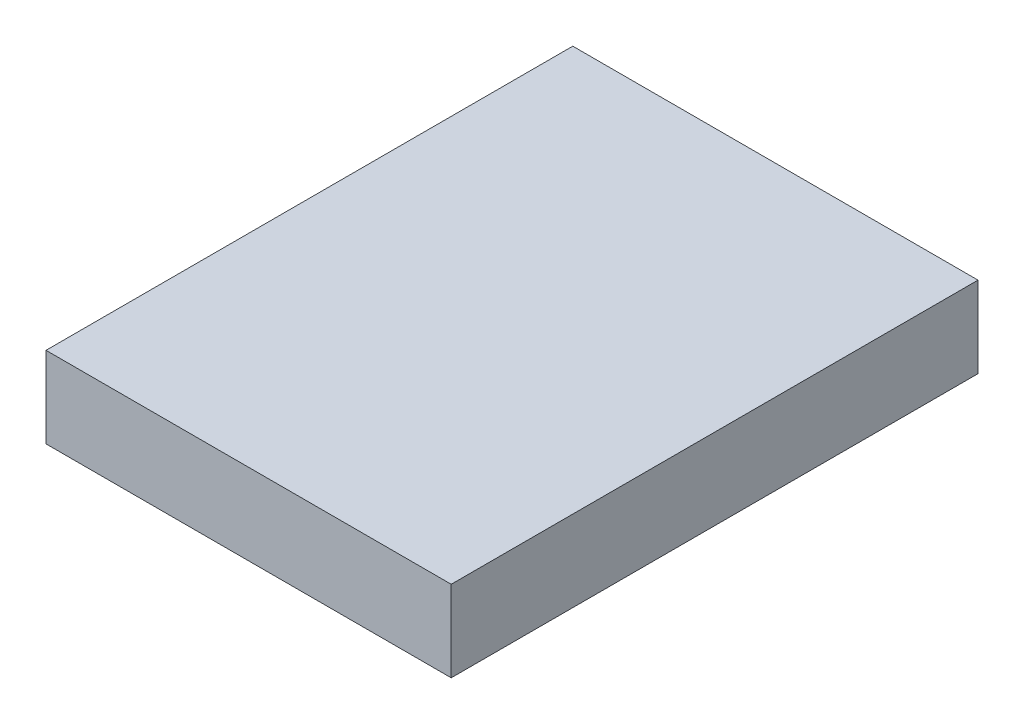
ISO-10303-21;
HEADER;
FILE_DESCRIPTION(('STEP AP214'),'2;1');
FILE_NAME('part.step','',(''),(''),'','','');
FILE_SCHEMA(('AUTOMOTIVE_DESIGN { 1 0 10303 214 1 1 1 1 }'));
ENDSEC;
DATA;
#1=APPLICATION_CONTEXT('core data for automotive mechanical design processes');
#2=APPLICATION_PROTOCOL_DEFINITION('international standard','automotive_design',2000,#1);
#3=PRODUCT_CONTEXT('',#1,'mechanical');
#4=PRODUCT('Part','Part','',(#3));
#5=PRODUCT_RELATED_PRODUCT_CATEGORY('part','',(#4));
#6=PRODUCT_DEFINITION_FORMATION('','',#4);
#7=PRODUCT_DEFINITION_CONTEXT('part definition',#1,'design');
#8=PRODUCT_DEFINITION('design','',#6,#7);
#9=PRODUCT_DEFINITION_SHAPE('','',#8);
#10=(LENGTH_UNIT() NAMED_UNIT(*) SI_UNIT(.MILLI.,.METRE.));
#11=(NAMED_UNIT(*) PLANE_ANGLE_UNIT() SI_UNIT($,.RADIAN.));
#12=(NAMED_UNIT(*) SI_UNIT($,.STERADIAN.) SOLID_ANGLE_UNIT());
#13=UNCERTAINTY_MEASURE_WITH_UNIT(LENGTH_MEASURE(1.E-05),#10,'distance_accuracy_value','');
#14=(GEOMETRIC_REPRESENTATION_CONTEXT(3) GLOBAL_UNCERTAINTY_ASSIGNED_CONTEXT((#13)) GLOBAL_UNIT_ASSIGNED_CONTEXT((#10,
#11,#12)) REPRESENTATION_CONTEXT('',''));
#15=CARTESIAN_POINT('',(0.,0.,0.));
#16=DIRECTION('',(0.,0.,1.));
#17=DIRECTION('',(1.,0.,0.));
#18=AXIS2_PLACEMENT_3D('',#15,#16,#17);
#19=CARTESIAN_POINT('',(0.,0.2,0.));
#20=DIRECTION('',(0.,1.,0.));
#21=DIRECTION('',(-1.,0.,0.));
#22=AXIS2_PLACEMENT_3D('',#19,#20,#21);
#23=PLANE('',#22);
#24=DIRECTION('',(0.,0.,-1.));
#25=VECTOR('',#24,1.);
#26=CARTESIAN_POINT('',(0.550000000000034,0.199999999999985,4.25));
#27=LINE('',#26,#25);
#28=CARTESIAN_POINT('',(0.550000000000034,0.199999999999985,4.25));
#29=VERTEX_POINT('',#28);
#30=CARTESIAN_POINT('',(0.550000000000034,0.199999999999989,2.94999999999999));
#31=VERTEX_POINT('',#30);
#32=EDGE_CURVE('E11',#29,#31,#27,.T.);
#33=ORIENTED_EDGE('',*,*,#32,.F.);
#34=DIRECTION('',(-1.,0.,0.));
#35=VECTOR('',#34,1.);
#36=CARTESIAN_POINT('',(0.550000000000034,0.199999999999985,4.25));
#37=LINE('',#36,#35);
#38=CARTESIAN_POINT('',(1.55000000000002,0.199999999999985,4.25000000000001));
#39=VERTEX_POINT('',#38);
#40=EDGE_CURVE('E24',#39,#29,#37,.T.);
#41=ORIENTED_EDGE('',*,*,#40,.F.);
#42=DIRECTION('',(0.,0.,1.));
#43=VECTOR('',#42,1.);
#44=CARTESIAN_POINT('',(1.55000000000002,0.199999999999985,4.25));
#45=LINE('',#44,#43);
#46=CARTESIAN_POINT('',(1.55000000000002,0.199999999999989,2.94999999999999));
#47=VERTEX_POINT('',#46);
#48=EDGE_CURVE('E75',#47,#39,#45,.T.);
#49=ORIENTED_EDGE('',*,*,#48,.F.);
#50=DIRECTION('',(1.,0.,0.));
#51=VECTOR('',#50,1.);
#52=CARTESIAN_POINT('',(0.550000000000034,0.199999999999989,2.94999999999999));
#53=LINE('',#52,#51);
#54=EDGE_CURVE('E85',#31,#47,#53,.T.);
#55=ORIENTED_EDGE('',*,*,#54,.F.);
#56=EDGE_LOOP('',(#33,#41,#49,#55));
#57=FACE_BOUND('',#56,.T.);
#58=ADVANCED_FACE('F17',(#57),#23,.T.);
#59=CARTESIAN_POINT('',(0.,0.,0.));
#60=DIRECTION('',(0.,-1.,0.));
#61=DIRECTION('',(0.,0.,-1.));
#62=AXIS2_PLACEMENT_3D('',#59,#60,#61);
#63=PLANE('',#62);
#64=DIRECTION('',(0.,0.,-1.));
#65=VECTOR('',#64,1.);
#66=CARTESIAN_POINT('',(0.550000000000034,0.,4.25));
#67=LINE('',#66,#65);
#68=CARTESIAN_POINT('',(0.550000000000034,0.,4.25));
#69=VERTEX_POINT('',#68);
#70=CARTESIAN_POINT('',(0.550000000000034,0.,2.94999999999999));
#71=VERTEX_POINT('',#70);
#72=EDGE_CURVE('E83',#69,#71,#67,.T.);
#73=ORIENTED_EDGE('',*,*,#72,.T.);
#74=DIRECTION('',(1.,0.,0.));
#75=VECTOR('',#74,1.);
#76=CARTESIAN_POINT('',(0.550000000000034,0.,2.94999999999999));
#77=LINE('',#76,#75);
#78=CARTESIAN_POINT('',(1.55000000000002,0.,2.94999999999999));
#79=VERTEX_POINT('',#78);
#80=EDGE_CURVE('E60',#71,#79,#77,.T.);
#81=ORIENTED_EDGE('',*,*,#80,.T.);
#82=DIRECTION('',(0.,0.,1.));
#83=VECTOR('',#82,1.);
#84=CARTESIAN_POINT('',(1.55000000000002,0.,4.25));
#85=LINE('',#84,#83);
#86=CARTESIAN_POINT('',(1.55000000000002,0.,4.25));
#87=VERTEX_POINT('',#86);
#88=EDGE_CURVE('E54',#79,#87,#85,.T.);
#89=ORIENTED_EDGE('',*,*,#88,.T.);
#90=DIRECTION('',(-1.,0.,0.));
#91=VECTOR('',#90,1.);
#92=CARTESIAN_POINT('',(0.550000000000034,0.,4.25));
#93=LINE('',#92,#91);
#94=EDGE_CURVE('E57',#87,#69,#93,.T.);
#95=ORIENTED_EDGE('',*,*,#94,.T.);
#96=EDGE_LOOP('',(#73,#81,#89,#95));
#97=FACE_BOUND('',#96,.T.);
#98=ADVANCED_FACE('F56',(#97),#63,.T.);
#99=CARTESIAN_POINT('',(0.550000000000034,4.22492235949961,2.95000000000001));
#100=DIRECTION('',(0.,0.,-1.));
#101=DIRECTION('',(0.,1.,0.));
#102=AXIS2_PLACEMENT_3D('',#99,#100,#101);
#103=PLANE('',#102);
#104=DIRECTION('',(0.,-1.,0.));
#105=VECTOR('',#104,1.);
#106=CARTESIAN_POINT('',(0.550000000000034,4.22492235949961,2.95000000000001));
#107=LINE('',#106,#105);
#108=EDGE_CURVE('E71',#31,#71,#107,.T.);
#109=ORIENTED_EDGE('',*,*,#108,.F.);
#110=ORIENTED_EDGE('',*,*,#54,.T.);
#111=DIRECTION('',(0.,-1.,0.));
#112=VECTOR('',#111,1.);
#113=CARTESIAN_POINT('',(1.55000000000002,4.22492235949961,2.95000000000001));
#114=LINE('',#113,#112);
#115=EDGE_CURVE('E76',#47,#79,#114,.T.);
#116=ORIENTED_EDGE('',*,*,#115,.T.);
#117=ORIENTED_EDGE('',*,*,#80,.F.);
#118=EDGE_LOOP('',(#109,#110,#116,#117));
#119=FACE_BOUND('',#118,.T.);
#120=ADVANCED_FACE('F91',(#119),#103,.T.);
#121=CARTESIAN_POINT('',(1.55000000000002,4.22492235949961,4.25000000000001));
#122=DIRECTION('',(1.,0.,0.));
#123=DIRECTION('',(0.,1.,0.));
#124=AXIS2_PLACEMENT_3D('',#121,#122,#123);
#125=PLANE('',#124);
#126=ORIENTED_EDGE('',*,*,#115,.F.);
#127=ORIENTED_EDGE('',*,*,#48,.T.);
#128=DIRECTION('',(0.,-1.,0.));
#129=VECTOR('',#128,1.);
#130=CARTESIAN_POINT('',(1.55000000000002,4.22492235949961,4.25000000000001));
#131=LINE('',#130,#129);
#132=EDGE_CURVE('E69',#39,#87,#131,.T.);
#133=ORIENTED_EDGE('',*,*,#132,.T.);
#134=ORIENTED_EDGE('',*,*,#88,.F.);
#135=EDGE_LOOP('',(#126,#127,#133,#134));
#136=FACE_BOUND('',#135,.T.);
#137=ADVANCED_FACE('F74',(#136),#125,.T.);
#138=CARTESIAN_POINT('',(0.550000000000034,4.22492235949961,4.25000000000001));
#139=DIRECTION('',(0.,0.,1.));
#140=DIRECTION('',(0.,-1.,0.));
#141=AXIS2_PLACEMENT_3D('',#138,#139,#140);
#142=PLANE('',#141);
#143=ORIENTED_EDGE('',*,*,#132,.F.);
#144=ORIENTED_EDGE('',*,*,#40,.T.);
#145=DIRECTION('',(0.,-1.,0.));
#146=VECTOR('',#145,1.);
#147=CARTESIAN_POINT('',(0.550000000000034,4.22492235949961,4.25000000000001));
#148=LINE('',#147,#146);
#149=EDGE_CURVE('E70',#29,#69,#148,.T.);
#150=ORIENTED_EDGE('',*,*,#149,.T.);
#151=ORIENTED_EDGE('',*,*,#94,.F.);
#152=EDGE_LOOP('',(#143,#144,#150,#151));
#153=FACE_BOUND('',#152,.T.);
#154=ADVANCED_FACE('F68',(#153),#142,.T.);
#155=CARTESIAN_POINT('',(0.550000000000034,4.22492235949961,4.25000000000001));
#156=DIRECTION('',(-1.,0.,0.));
#157=DIRECTION('',(0.,-1.,0.));
#158=AXIS2_PLACEMENT_3D('',#155,#156,#157);
#159=PLANE('',#158);
#160=ORIENTED_EDGE('',*,*,#149,.F.);
#161=ORIENTED_EDGE('',*,*,#32,.T.);
#162=ORIENTED_EDGE('',*,*,#108,.T.);
#163=ORIENTED_EDGE('',*,*,#72,.F.);
#164=EDGE_LOOP('',(#160,#161,#162,#163));
#165=FACE_BOUND('',#164,.T.);
#166=ADVANCED_FACE('F88',(#165),#159,.T.);
#167=CLOSED_SHELL('',(#58,#98,#120,#137,#154,#166));
#168=MANIFOLD_SOLID_BREP('B1',#167);
#169=ADVANCED_BREP_SHAPE_REPRESENTATION('',(#18,#168),#14);
#170=SHAPE_DEFINITION_REPRESENTATION(#9,#169);
ENDSEC;
END-ISO-10303-21;
